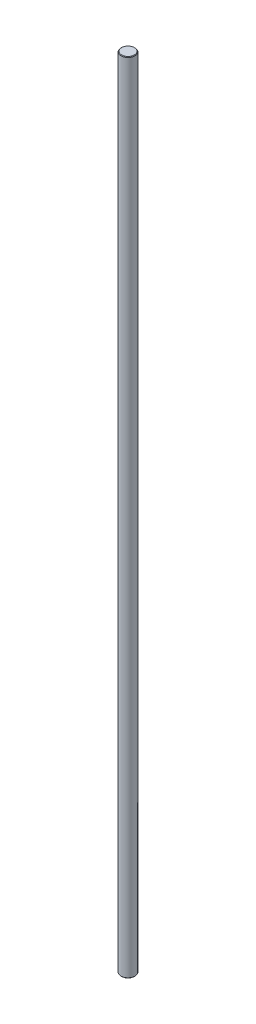
ISO-10303-21;
HEADER;
FILE_DESCRIPTION(('STEP AP214'),'2;1');
FILE_NAME('part.step','',(''),(''),'','','');
FILE_SCHEMA(('AUTOMOTIVE_DESIGN { 1 0 10303 214 1 1 1 1 }'));
ENDSEC;
DATA;
#1=APPLICATION_CONTEXT('core data for automotive mechanical design processes');
#2=APPLICATION_PROTOCOL_DEFINITION('international standard','automotive_design',2000,#1);
#3=PRODUCT_CONTEXT('',#1,'mechanical');
#4=PRODUCT('Part','Part','',(#3));
#5=PRODUCT_RELATED_PRODUCT_CATEGORY('part','',(#4));
#6=PRODUCT_DEFINITION_FORMATION('','',#4);
#7=PRODUCT_DEFINITION_CONTEXT('part definition',#1,'design');
#8=PRODUCT_DEFINITION('design','',#6,#7);
#9=PRODUCT_DEFINITION_SHAPE('','',#8);
#10=(LENGTH_UNIT() NAMED_UNIT(*) SI_UNIT(.MILLI.,.METRE.));
#11=(NAMED_UNIT(*) PLANE_ANGLE_UNIT() SI_UNIT($,.RADIAN.));
#12=(NAMED_UNIT(*) SI_UNIT($,.STERADIAN.) SOLID_ANGLE_UNIT());
#13=UNCERTAINTY_MEASURE_WITH_UNIT(LENGTH_MEASURE(1.E-05),#10,'distance_accuracy_value','');
#14=(GEOMETRIC_REPRESENTATION_CONTEXT(3) GLOBAL_UNCERTAINTY_ASSIGNED_CONTEXT((#13)) GLOBAL_UNIT_ASSIGNED_CONTEXT((#10,
#11,#12)) REPRESENTATION_CONTEXT('',''));
#15=CARTESIAN_POINT('',(0.,0.,0.));
#16=DIRECTION('',(0.,0.,1.));
#17=DIRECTION('',(1.,0.,0.));
#18=AXIS2_PLACEMENT_3D('',#15,#16,#17);
#19=CARTESIAN_POINT('',(0.,287.,0.));
#20=DIRECTION('',(0.,-1.,0.));
#21=DIRECTION('',(0.,0.,-1.));
#22=AXIS2_PLACEMENT_3D('',#19,#20,#21);
#23=CYLINDRICAL_SURFACE('',#22,2.5);
#24=CARTESIAN_POINT('',(0.,0.199999999999978,0.));
#25=DIRECTION('',(0.,1.,0.));
#26=DIRECTION('',(0.,0.,1.));
#27=AXIS2_PLACEMENT_3D('',#24,#25,#26);
#28=CIRCLE('',#27,2.5);
#29=CARTESIAN_POINT('',(0.,0.199999999999978,2.5));
#30=VERTEX_POINT('',#29);
#31=EDGE_CURVE('E49',#30,#30,#28,.T.);
#32=ORIENTED_EDGE('',*,*,#31,.T.);
#33=EDGE_LOOP('',(#32));
#34=FACE_BOUND('',#33,.T.);
#35=CARTESIAN_POINT('',(0.,286.8,0.));
#36=DIRECTION('',(0.,1.,0.));
#37=DIRECTION('',(0.,0.,1.));
#38=AXIS2_PLACEMENT_3D('',#35,#36,#37);
#39=CIRCLE('',#38,2.5);
#40=CARTESIAN_POINT('',(0.,286.8,2.5));
#41=VERTEX_POINT('',#40);
#42=EDGE_CURVE('E53',#41,#41,#39,.F.);
#43=ORIENTED_EDGE('',*,*,#42,.T.);
#44=EDGE_LOOP('',(#43));
#45=FACE_BOUND('',#44,.T.);
#46=ADVANCED_FACE('F37',(#34,#45),#23,.T.);
#47=CARTESIAN_POINT('',(0.,287.,0.));
#48=DIRECTION('',(0.,1.,0.));
#49=DIRECTION('',(0.,0.,1.));
#50=AXIS2_PLACEMENT_3D('',#47,#48,#49);
#51=PLANE('',#50);
#52=CARTESIAN_POINT('',(0.,287.,0.));
#53=DIRECTION('',(0.,1.,0.));
#54=DIRECTION('',(0.,0.,1.));
#55=AXIS2_PLACEMENT_3D('',#52,#53,#54);
#56=CIRCLE('',#55,2.3);
#57=CARTESIAN_POINT('',(0.,287.,2.3));
#58=VERTEX_POINT('',#57);
#59=EDGE_CURVE('E10',#58,#58,#56,.T.);
#60=ORIENTED_EDGE('',*,*,#59,.T.);
#61=EDGE_LOOP('',(#60));
#62=FACE_BOUND('',#61,.T.);
#63=ADVANCED_FACE('F69',(#62),#51,.T.);
#64=CARTESIAN_POINT('',(0.,0.,0.));
#65=DIRECTION('',(0.,1.,0.));
#66=DIRECTION('',(0.,0.,1.));
#67=AXIS2_PLACEMENT_3D('',#64,#65,#66);
#68=PLANE('',#67);
#69=CARTESIAN_POINT('',(0.,0.,0.));
#70=DIRECTION('',(0.,1.,0.));
#71=DIRECTION('',(0.,0.,1.));
#72=AXIS2_PLACEMENT_3D('',#69,#70,#71);
#73=CIRCLE('',#72,2.30000000000002);
#74=CARTESIAN_POINT('',(0.,0.,2.30000000000002));
#75=VERTEX_POINT('',#74);
#76=EDGE_CURVE('E45',#75,#75,#73,.F.);
#77=ORIENTED_EDGE('',*,*,#76,.T.);
#78=EDGE_LOOP('',(#77));
#79=FACE_BOUND('',#78,.T.);
#80=ADVANCED_FACE('F66',(#79),#68,.F.);
#81=CARTESIAN_POINT('',(0.,0.199999999999978,0.));
#82=DIRECTION('',(0.,1.,0.));
#83=DIRECTION('',(0.,0.,1.));
#84=AXIS2_PLACEMENT_3D('',#81,#82,#83);
#85=CONICAL_SURFACE('',#84,2.5,0.785398163397442);
#86=ORIENTED_EDGE('',*,*,#76,.F.);
#87=EDGE_LOOP('',(#86));
#88=FACE_BOUND('',#87,.T.);
#89=ORIENTED_EDGE('',*,*,#31,.F.);
#90=EDGE_LOOP('',(#89));
#91=FACE_BOUND('',#90,.T.);
#92=ADVANCED_FACE('F62',(#88,#91),#85,.T.);
#93=CARTESIAN_POINT('',(0.,287.,0.));
#94=DIRECTION('',(0.,-1.,0.));
#95=DIRECTION('',(0.,0.,-1.));
#96=AXIS2_PLACEMENT_3D('',#93,#94,#95);
#97=CONICAL_SURFACE('',#96,2.3,0.785398163397511);
#98=ORIENTED_EDGE('',*,*,#42,.F.);
#99=EDGE_LOOP('',(#98));
#100=FACE_BOUND('',#99,.T.);
#101=ORIENTED_EDGE('',*,*,#59,.F.);
#102=EDGE_LOOP('',(#101));
#103=FACE_BOUND('',#102,.T.);
#104=ADVANCED_FACE('F40',(#100,#103),#97,.T.);
#105=CLOSED_SHELL('',(#46,#63,#80,#92,#104));
#106=MANIFOLD_SOLID_BREP('B2',#105);
#107=ADVANCED_BREP_SHAPE_REPRESENTATION('',(#18,#106),#14);
#108=SHAPE_DEFINITION_REPRESENTATION(#9,#107);
ENDSEC;
END-ISO-10303-21;
